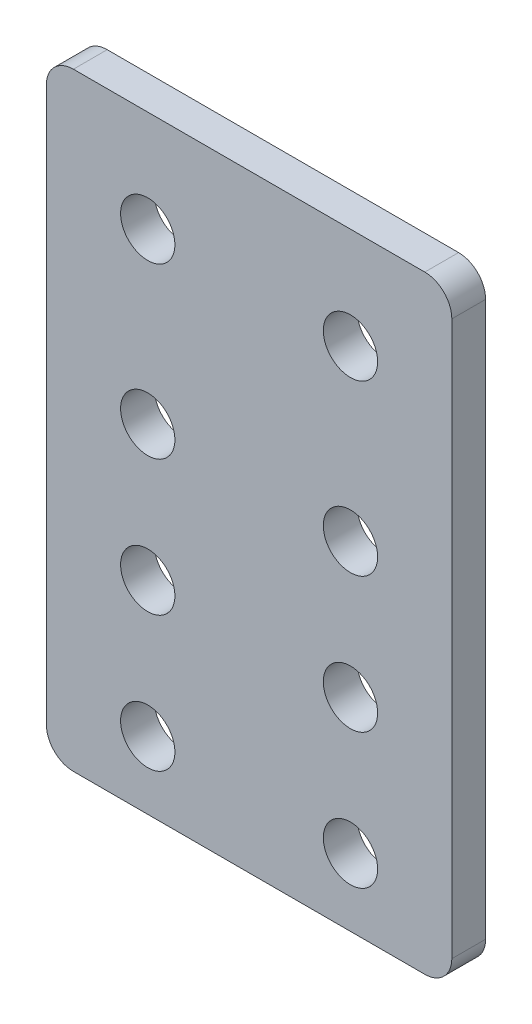
ISO-10303-21;
HEADER;
FILE_DESCRIPTION(('STEP AP214'),'2;1');
FILE_NAME('part.step','',(''),(''),'','','');
FILE_SCHEMA(('AUTOMOTIVE_DESIGN { 1 0 10303 214 1 1 1 1 }'));
ENDSEC;
DATA;
#1=APPLICATION_CONTEXT('core data for automotive mechanical design processes');
#2=APPLICATION_PROTOCOL_DEFINITION('international standard','automotive_design',2000,#1);
#3=PRODUCT_CONTEXT('',#1,'mechanical');
#4=PRODUCT('Part','Part','',(#3));
#5=PRODUCT_RELATED_PRODUCT_CATEGORY('part','',(#4));
#6=PRODUCT_DEFINITION_FORMATION('','',#4);
#7=PRODUCT_DEFINITION_CONTEXT('part definition',#1,'design');
#8=PRODUCT_DEFINITION('design','',#6,#7);
#9=PRODUCT_DEFINITION_SHAPE('','',#8);
#10=(LENGTH_UNIT() NAMED_UNIT(*) SI_UNIT(.MILLI.,.METRE.));
#11=(NAMED_UNIT(*) PLANE_ANGLE_UNIT() SI_UNIT($,.RADIAN.));
#12=(NAMED_UNIT(*) SI_UNIT($,.STERADIAN.) SOLID_ANGLE_UNIT());
#13=UNCERTAINTY_MEASURE_WITH_UNIT(LENGTH_MEASURE(1.E-05),#10,'distance_accuracy_value','');
#14=(GEOMETRIC_REPRESENTATION_CONTEXT(3) GLOBAL_UNCERTAINTY_ASSIGNED_CONTEXT((#13)) GLOBAL_UNIT_ASSIGNED_CONTEXT((#10,
#11,#12)) REPRESENTATION_CONTEXT('',''));
#15=CARTESIAN_POINT('',(0.,0.,0.));
#16=DIRECTION('',(0.,0.,1.));
#17=DIRECTION('',(1.,0.,0.));
#18=AXIS2_PLACEMENT_3D('',#15,#16,#17);
#19=CARTESIAN_POINT('',(0.,0.,3.175));
#20=DIRECTION('',(0.,0.,-1.));
#21=DIRECTION('',(-1.,0.,0.));
#22=AXIS2_PLACEMENT_3D('',#19,#20,#21);
#23=PLANE('',#22);
#24=DIRECTION('',(-1.,0.,0.));
#25=VECTOR('',#24,1.);
#26=CARTESIAN_POINT('',(-19.05,28.575,3.175));
#27=LINE('',#26,#25);
#28=CARTESIAN_POINT('',(16.51,28.575,3.175));
#29=VERTEX_POINT('',#28);
#30=CARTESIAN_POINT('',(-16.51,28.575,3.175));
#31=VERTEX_POINT('',#30);
#32=EDGE_CURVE('E196',#29,#31,#27,.T.);
#33=ORIENTED_EDGE('',*,*,#32,.T.);
#34=CARTESIAN_POINT('',(-16.51,26.035,3.175));
#35=DIRECTION('',(0.,0.,-1.));
#36=DIRECTION('',(-1.,0.,0.));
#37=AXIS2_PLACEMENT_3D('',#34,#35,#36);
#38=CIRCLE('',#37,2.54);
#39=CARTESIAN_POINT('',(-19.05,26.035,3.175));
#40=VERTEX_POINT('',#39);
#41=EDGE_CURVE('E172',#31,#40,#38,.F.);
#42=ORIENTED_EDGE('',*,*,#41,.T.);
#43=DIRECTION('',(0.,-1.,0.));
#44=VECTOR('',#43,1.);
#45=CARTESIAN_POINT('',(-19.05,-28.575,3.175));
#46=LINE('',#45,#44);
#47=CARTESIAN_POINT('',(-19.05,-26.035,3.175));
#48=VERTEX_POINT('',#47);
#49=EDGE_CURVE('E129',#40,#48,#46,.T.);
#50=ORIENTED_EDGE('',*,*,#49,.T.);
#51=CARTESIAN_POINT('',(-16.51,-26.035,3.175));
#52=DIRECTION('',(0.,0.,-1.));
#53=DIRECTION('',(-1.,0.,0.));
#54=AXIS2_PLACEMENT_3D('',#51,#52,#53);
#55=CIRCLE('',#54,2.54);
#56=CARTESIAN_POINT('',(-16.51,-28.575,3.175));
#57=VERTEX_POINT('',#56);
#58=EDGE_CURVE('E64',#48,#57,#55,.F.);
#59=ORIENTED_EDGE('',*,*,#58,.T.);
#60=DIRECTION('',(1.,0.,0.));
#61=VECTOR('',#60,1.);
#62=CARTESIAN_POINT('',(-19.05,-28.575,3.175));
#63=LINE('',#62,#61);
#64=CARTESIAN_POINT('',(16.51,-28.575,3.175));
#65=VERTEX_POINT('',#64);
#66=EDGE_CURVE('E150',#57,#65,#63,.T.);
#67=ORIENTED_EDGE('',*,*,#66,.T.);
#68=CARTESIAN_POINT('',(16.51,-26.035,3.175));
#69=DIRECTION('',(0.,0.,-1.));
#70=DIRECTION('',(-1.,0.,0.));
#71=AXIS2_PLACEMENT_3D('',#68,#69,#70);
#72=CIRCLE('',#71,2.54);
#73=CARTESIAN_POINT('',(19.05,-26.035,3.175));
#74=VERTEX_POINT('',#73);
#75=EDGE_CURVE('E167',#65,#74,#72,.F.);
#76=ORIENTED_EDGE('',*,*,#75,.T.);
#77=DIRECTION('',(0.,1.,0.));
#78=VECTOR('',#77,1.);
#79=CARTESIAN_POINT('',(19.05,-28.575,3.175));
#80=LINE('',#79,#78);
#81=CARTESIAN_POINT('',(19.05,26.035,3.175));
#82=VERTEX_POINT('',#81);
#83=EDGE_CURVE('E143',#74,#82,#80,.T.);
#84=ORIENTED_EDGE('',*,*,#83,.T.);
#85=CARTESIAN_POINT('',(16.51,26.035,3.175));
#86=DIRECTION('',(0.,0.,-1.));
#87=DIRECTION('',(-1.,0.,0.));
#88=AXIS2_PLACEMENT_3D('',#85,#86,#87);
#89=CIRCLE('',#88,2.54);
#90=EDGE_CURVE('E164',#82,#29,#89,.F.);
#91=ORIENTED_EDGE('',*,*,#90,.T.);
#92=EDGE_LOOP('',(#33,#42,#50,#59,#67,#76,#84,#91));
#93=FACE_BOUND('',#92,.T.);
#94=CARTESIAN_POINT('',(-9.525,-22.225,3.175));
#95=DIRECTION('',(0.,0.,1.));
#96=DIRECTION('',(1.,0.,0.));
#97=AXIS2_PLACEMENT_3D('',#94,#95,#96);
#98=CIRCLE('',#97,2.5527);
#99=CARTESIAN_POINT('',(-6.9723,-22.225,3.175));
#100=VERTEX_POINT('',#99);
#101=EDGE_CURVE('E202',#100,#100,#98,.T.);
#102=ORIENTED_EDGE('',*,*,#101,.F.);
#103=EDGE_LOOP('',(#102));
#104=FACE_BOUND('',#103,.T.);
#105=CARTESIAN_POINT('',(-9.525,-9.525,3.175));
#106=DIRECTION('',(0.,0.,1.));
#107=DIRECTION('',(1.,0.,0.));
#108=AXIS2_PLACEMENT_3D('',#105,#106,#107);
#109=CIRCLE('',#108,2.5527);
#110=CARTESIAN_POINT('',(-6.9723,-9.525,3.175));
#111=VERTEX_POINT('',#110);
#112=EDGE_CURVE('E216',#111,#111,#109,.T.);
#113=ORIENTED_EDGE('',*,*,#112,.F.);
#114=EDGE_LOOP('',(#113));
#115=FACE_BOUND('',#114,.T.);
#116=CARTESIAN_POINT('',(-9.525,3.175,3.175));
#117=DIRECTION('',(0.,0.,1.));
#118=DIRECTION('',(1.,0.,0.));
#119=AXIS2_PLACEMENT_3D('',#116,#117,#118);
#120=CIRCLE('',#119,2.5527);
#121=CARTESIAN_POINT('',(-6.9723,3.175,3.175));
#122=VERTEX_POINT('',#121);
#123=EDGE_CURVE('E222',#122,#122,#120,.T.);
#124=ORIENTED_EDGE('',*,*,#123,.F.);
#125=EDGE_LOOP('',(#124));
#126=FACE_BOUND('',#125,.T.);
#127=CARTESIAN_POINT('',(-9.525,19.05,3.175));
#128=DIRECTION('',(0.,0.,1.));
#129=DIRECTION('',(1.,0.,0.));
#130=AXIS2_PLACEMENT_3D('',#127,#128,#129);
#131=CIRCLE('',#130,2.5527);
#132=CARTESIAN_POINT('',(-6.9723,19.05,3.175));
#133=VERTEX_POINT('',#132);
#134=EDGE_CURVE('E230',#133,#133,#131,.T.);
#135=ORIENTED_EDGE('',*,*,#134,.F.);
#136=EDGE_LOOP('',(#135));
#137=FACE_BOUND('',#136,.T.);
#138=CARTESIAN_POINT('',(9.52500000000001,-22.225,3.175));
#139=DIRECTION('',(0.,0.,1.));
#140=DIRECTION('',(1.,0.,0.));
#141=AXIS2_PLACEMENT_3D('',#138,#139,#140);
#142=CIRCLE('',#141,2.5527);
#143=CARTESIAN_POINT('',(12.0777,-22.225,3.175));
#144=VERTEX_POINT('',#143);
#145=EDGE_CURVE('E238',#144,#144,#142,.T.);
#146=ORIENTED_EDGE('',*,*,#145,.F.);
#147=EDGE_LOOP('',(#146));
#148=FACE_BOUND('',#147,.T.);
#149=CARTESIAN_POINT('',(9.52500000000001,-9.52499999999999,3.175));
#150=DIRECTION('',(0.,0.,1.));
#151=DIRECTION('',(1.,0.,0.));
#152=AXIS2_PLACEMENT_3D('',#149,#150,#151);
#153=CIRCLE('',#152,2.5527);
#154=CARTESIAN_POINT('',(12.0777,-9.52499999999999,3.175));
#155=VERTEX_POINT('',#154);
#156=EDGE_CURVE('E246',#155,#155,#153,.T.);
#157=ORIENTED_EDGE('',*,*,#156,.F.);
#158=EDGE_LOOP('',(#157));
#159=FACE_BOUND('',#158,.T.);
#160=CARTESIAN_POINT('',(9.52500000000001,3.17500000000001,3.175));
#161=DIRECTION('',(0.,0.,1.));
#162=DIRECTION('',(-1.,0.,0.));
#163=AXIS2_PLACEMENT_3D('',#160,#161,#162);
#164=CIRCLE('',#163,2.5527);
#165=CARTESIAN_POINT('',(6.97230000000001,3.17500000000001,3.175));
#166=VERTEX_POINT('',#165);
#167=EDGE_CURVE('E254',#166,#166,#164,.T.);
#168=ORIENTED_EDGE('',*,*,#167,.F.);
#169=EDGE_LOOP('',(#168));
#170=FACE_BOUND('',#169,.T.);
#171=CARTESIAN_POINT('',(9.525,19.05,3.175));
#172=DIRECTION('',(0.,0.,1.));
#173=DIRECTION('',(-1.,0.,0.));
#174=AXIS2_PLACEMENT_3D('',#171,#172,#173);
#175=CIRCLE('',#174,2.5527);
#176=CARTESIAN_POINT('',(6.9723,19.05,3.175));
#177=VERTEX_POINT('',#176);
#178=EDGE_CURVE('E262',#177,#177,#175,.T.);
#179=ORIENTED_EDGE('',*,*,#178,.F.);
#180=EDGE_LOOP('',(#179));
#181=FACE_BOUND('',#180,.T.);
#182=ADVANCED_FACE('F41',(#93,#104,#115,#126,#137,#148,#159,#170,#181),#23,.F.);
#183=CARTESIAN_POINT('',(0.,0.,0.));
#184=DIRECTION('',(0.,0.,-1.));
#185=DIRECTION('',(-1.,0.,0.));
#186=AXIS2_PLACEMENT_3D('',#183,#184,#185);
#187=PLANE('',#186);
#188=CARTESIAN_POINT('',(9.52500000000001,3.17500000000001,0.));
#189=DIRECTION('',(0.,0.,1.));
#190=DIRECTION('',(-1.,0.,0.));
#191=AXIS2_PLACEMENT_3D('',#188,#189,#190);
#192=CIRCLE('',#191,2.5527);
#193=CARTESIAN_POINT('',(6.97230000000001,3.17500000000001,0.));
#194=VERTEX_POINT('',#193);
#195=EDGE_CURVE('E258',#194,#194,#192,.T.);
#196=ORIENTED_EDGE('',*,*,#195,.T.);
#197=EDGE_LOOP('',(#196));
#198=FACE_BOUND('',#197,.T.);
#199=CARTESIAN_POINT('',(9.52500000000001,-22.225,0.));
#200=DIRECTION('',(0.,0.,1.));
#201=DIRECTION('',(1.,0.,0.));
#202=AXIS2_PLACEMENT_3D('',#199,#200,#201);
#203=CIRCLE('',#202,2.5527);
#204=CARTESIAN_POINT('',(12.0777,-22.225,0.));
#205=VERTEX_POINT('',#204);
#206=EDGE_CURVE('E242',#205,#205,#203,.T.);
#207=ORIENTED_EDGE('',*,*,#206,.T.);
#208=EDGE_LOOP('',(#207));
#209=FACE_BOUND('',#208,.T.);
#210=CARTESIAN_POINT('',(-9.525,3.175,0.));
#211=DIRECTION('',(0.,0.,1.));
#212=DIRECTION('',(1.,0.,0.));
#213=AXIS2_PLACEMENT_3D('',#210,#211,#212);
#214=CIRCLE('',#213,2.5527);
#215=CARTESIAN_POINT('',(-6.9723,3.175,0.));
#216=VERTEX_POINT('',#215);
#217=EDGE_CURVE('E226',#216,#216,#214,.T.);
#218=ORIENTED_EDGE('',*,*,#217,.T.);
#219=EDGE_LOOP('',(#218));
#220=FACE_BOUND('',#219,.T.);
#221=CARTESIAN_POINT('',(-9.525,-22.225,0.));
#222=DIRECTION('',(0.,0.,1.));
#223=DIRECTION('',(1.,0.,0.));
#224=AXIS2_PLACEMENT_3D('',#221,#222,#223);
#225=CIRCLE('',#224,2.5527);
#226=CARTESIAN_POINT('',(-6.9723,-22.225,0.));
#227=VERTEX_POINT('',#226);
#228=EDGE_CURVE('E205',#227,#227,#225,.T.);
#229=ORIENTED_EDGE('',*,*,#228,.T.);
#230=EDGE_LOOP('',(#229));
#231=FACE_BOUND('',#230,.T.);
#232=DIRECTION('',(0.,-1.,0.));
#233=VECTOR('',#232,1.);
#234=CARTESIAN_POINT('',(-19.05,-28.575,0.));
#235=LINE('',#234,#233);
#236=CARTESIAN_POINT('',(-19.05,26.035,0.));
#237=VERTEX_POINT('',#236);
#238=CARTESIAN_POINT('',(-19.05,-26.035,0.));
#239=VERTEX_POINT('',#238);
#240=EDGE_CURVE('E127',#237,#239,#235,.T.);
#241=ORIENTED_EDGE('',*,*,#240,.F.);
#242=CARTESIAN_POINT('',(-16.51,26.035,0.));
#243=DIRECTION('',(0.,0.,-1.));
#244=DIRECTION('',(-1.,0.,0.));
#245=AXIS2_PLACEMENT_3D('',#242,#243,#244);
#246=CIRCLE('',#245,2.54);
#247=CARTESIAN_POINT('',(-16.51,28.575,0.));
#248=VERTEX_POINT('',#247);
#249=EDGE_CURVE('E109',#237,#248,#246,.T.);
#250=ORIENTED_EDGE('',*,*,#249,.T.);
#251=DIRECTION('',(-1.,0.,0.));
#252=VECTOR('',#251,1.);
#253=CARTESIAN_POINT('',(-19.05,28.575,0.));
#254=LINE('',#253,#252);
#255=CARTESIAN_POINT('',(16.51,28.575,0.));
#256=VERTEX_POINT('',#255);
#257=EDGE_CURVE('E139',#256,#248,#254,.T.);
#258=ORIENTED_EDGE('',*,*,#257,.F.);
#259=CARTESIAN_POINT('',(16.51,26.035,0.));
#260=DIRECTION('',(0.,0.,-1.));
#261=DIRECTION('',(-1.,0.,0.));
#262=AXIS2_PLACEMENT_3D('',#259,#260,#261);
#263=CIRCLE('',#262,2.54);
#264=CARTESIAN_POINT('',(19.05,26.035,0.));
#265=VERTEX_POINT('',#264);
#266=EDGE_CURVE('E131',#256,#265,#263,.T.);
#267=ORIENTED_EDGE('',*,*,#266,.T.);
#268=DIRECTION('',(0.,1.,0.));
#269=VECTOR('',#268,1.);
#270=CARTESIAN_POINT('',(19.05,-28.575,0.));
#271=LINE('',#270,#269);
#272=CARTESIAN_POINT('',(19.05,-26.035,0.));
#273=VERTEX_POINT('',#272);
#274=EDGE_CURVE('E145',#273,#265,#271,.T.);
#275=ORIENTED_EDGE('',*,*,#274,.F.);
#276=CARTESIAN_POINT('',(16.51,-26.035,0.));
#277=DIRECTION('',(0.,0.,-1.));
#278=DIRECTION('',(-1.,0.,0.));
#279=AXIS2_PLACEMENT_3D('',#276,#277,#278);
#280=CIRCLE('',#279,2.54);
#281=CARTESIAN_POINT('',(16.51,-28.575,0.));
#282=VERTEX_POINT('',#281);
#283=EDGE_CURVE('E154',#273,#282,#280,.T.);
#284=ORIENTED_EDGE('',*,*,#283,.T.);
#285=DIRECTION('',(1.,0.,0.));
#286=VECTOR('',#285,1.);
#287=CARTESIAN_POINT('',(-19.05,-28.575,0.));
#288=LINE('',#287,#286);
#289=CARTESIAN_POINT('',(-16.51,-28.575,0.));
#290=VERTEX_POINT('',#289);
#291=EDGE_CURVE('E138',#290,#282,#288,.T.);
#292=ORIENTED_EDGE('',*,*,#291,.F.);
#293=CARTESIAN_POINT('',(-16.51,-26.035,0.));
#294=DIRECTION('',(0.,0.,-1.));
#295=DIRECTION('',(-1.,0.,0.));
#296=AXIS2_PLACEMENT_3D('',#293,#294,#295);
#297=CIRCLE('',#296,2.54);
#298=EDGE_CURVE('E121',#290,#239,#297,.T.);
#299=ORIENTED_EDGE('',*,*,#298,.T.);
#300=EDGE_LOOP('',(#241,#250,#258,#267,#275,#284,#292,#299));
#301=FACE_BOUND('',#300,.T.);
#302=CARTESIAN_POINT('',(-9.525,-9.525,0.));
#303=DIRECTION('',(0.,0.,1.));
#304=DIRECTION('',(1.,0.,0.));
#305=AXIS2_PLACEMENT_3D('',#302,#303,#304);
#306=CIRCLE('',#305,2.5527);
#307=CARTESIAN_POINT('',(-6.9723,-9.525,0.));
#308=VERTEX_POINT('',#307);
#309=EDGE_CURVE('E218',#308,#308,#306,.T.);
#310=ORIENTED_EDGE('',*,*,#309,.T.);
#311=EDGE_LOOP('',(#310));
#312=FACE_BOUND('',#311,.T.);
#313=CARTESIAN_POINT('',(-9.525,19.05,0.));
#314=DIRECTION('',(0.,0.,1.));
#315=DIRECTION('',(1.,0.,0.));
#316=AXIS2_PLACEMENT_3D('',#313,#314,#315);
#317=CIRCLE('',#316,2.5527);
#318=CARTESIAN_POINT('',(-6.9723,19.05,0.));
#319=VERTEX_POINT('',#318);
#320=EDGE_CURVE('E234',#319,#319,#317,.T.);
#321=ORIENTED_EDGE('',*,*,#320,.T.);
#322=EDGE_LOOP('',(#321));
#323=FACE_BOUND('',#322,.T.);
#324=CARTESIAN_POINT('',(9.52500000000001,-9.52499999999999,0.));
#325=DIRECTION('',(0.,0.,1.));
#326=DIRECTION('',(1.,0.,0.));
#327=AXIS2_PLACEMENT_3D('',#324,#325,#326);
#328=CIRCLE('',#327,2.5527);
#329=CARTESIAN_POINT('',(12.0777,-9.52499999999999,0.));
#330=VERTEX_POINT('',#329);
#331=EDGE_CURVE('E250',#330,#330,#328,.T.);
#332=ORIENTED_EDGE('',*,*,#331,.T.);
#333=EDGE_LOOP('',(#332));
#334=FACE_BOUND('',#333,.T.);
#335=CARTESIAN_POINT('',(9.525,19.05,0.));
#336=DIRECTION('',(0.,0.,1.));
#337=DIRECTION('',(-1.,0.,0.));
#338=AXIS2_PLACEMENT_3D('',#335,#336,#337);
#339=CIRCLE('',#338,2.5527);
#340=CARTESIAN_POINT('',(6.9723,19.05,0.));
#341=VERTEX_POINT('',#340);
#342=EDGE_CURVE('E266',#341,#341,#339,.T.);
#343=ORIENTED_EDGE('',*,*,#342,.T.);
#344=EDGE_LOOP('',(#343));
#345=FACE_BOUND('',#344,.T.);
#346=ADVANCED_FACE('F134',(#198,#209,#220,#231,#301,#312,#323,#334,#345),#187,.T.);
#347=CARTESIAN_POINT('',(19.05,-28.575,3.175));
#348=DIRECTION('',(-1.,0.,0.));
#349=DIRECTION('',(0.,-1.,0.));
#350=AXIS2_PLACEMENT_3D('',#347,#348,#349);
#351=PLANE('',#350);
#352=ORIENTED_EDGE('',*,*,#83,.F.);
#353=DIRECTION('',(0.,0.,-1.));
#354=VECTOR('',#353,1.);
#355=CARTESIAN_POINT('',(19.05,-26.035,3.175));
#356=LINE('',#355,#354);
#357=EDGE_CURVE('E11',#74,#273,#356,.T.);
#358=ORIENTED_EDGE('',*,*,#357,.T.);
#359=ORIENTED_EDGE('',*,*,#274,.T.);
#360=DIRECTION('',(0.,0.,-1.));
#361=VECTOR('',#360,1.);
#362=CARTESIAN_POINT('',(19.05,26.035,3.175));
#363=LINE('',#362,#361);
#364=EDGE_CURVE('E50',#265,#82,#363,.F.);
#365=ORIENTED_EDGE('',*,*,#364,.T.);
#366=EDGE_LOOP('',(#352,#358,#359,#365));
#367=FACE_BOUND('',#366,.T.);
#368=ADVANCED_FACE('F186',(#367),#351,.F.);
#369=CARTESIAN_POINT('',(-19.05,28.575,3.175));
#370=DIRECTION('',(0.,-1.,0.));
#371=DIRECTION('',(1.,0.,0.));
#372=AXIS2_PLACEMENT_3D('',#369,#370,#371);
#373=PLANE('',#372);
#374=ORIENTED_EDGE('',*,*,#257,.T.);
#375=DIRECTION('',(0.,0.,-1.));
#376=VECTOR('',#375,1.);
#377=CARTESIAN_POINT('',(-16.51,28.575,3.175));
#378=LINE('',#377,#376);
#379=EDGE_CURVE('E114',#248,#31,#378,.F.);
#380=ORIENTED_EDGE('',*,*,#379,.T.);
#381=ORIENTED_EDGE('',*,*,#32,.F.);
#382=DIRECTION('',(0.,0.,-1.));
#383=VECTOR('',#382,1.);
#384=CARTESIAN_POINT('',(16.51,28.575,3.175));
#385=LINE('',#384,#383);
#386=EDGE_CURVE('E120',#29,#256,#385,.T.);
#387=ORIENTED_EDGE('',*,*,#386,.T.);
#388=EDGE_LOOP('',(#374,#380,#381,#387));
#389=FACE_BOUND('',#388,.T.);
#390=ADVANCED_FACE('F200',(#389),#373,.F.);
#391=CARTESIAN_POINT('',(-19.05,-28.575,3.175));
#392=DIRECTION('',(1.,0.,0.));
#393=DIRECTION('',(0.,0.,-1.));
#394=AXIS2_PLACEMENT_3D('',#391,#392,#393);
#395=PLANE('',#394);
#396=ORIENTED_EDGE('',*,*,#49,.F.);
#397=DIRECTION('',(0.,0.,-1.));
#398=VECTOR('',#397,1.);
#399=CARTESIAN_POINT('',(-19.05,26.035,3.175));
#400=LINE('',#399,#398);
#401=EDGE_CURVE('E113',#40,#237,#400,.T.);
#402=ORIENTED_EDGE('',*,*,#401,.T.);
#403=ORIENTED_EDGE('',*,*,#240,.T.);
#404=DIRECTION('',(0.,0.,-1.));
#405=VECTOR('',#404,1.);
#406=CARTESIAN_POINT('',(-19.05,-26.035,3.175));
#407=LINE('',#406,#405);
#408=EDGE_CURVE('E132',#239,#48,#407,.F.);
#409=ORIENTED_EDGE('',*,*,#408,.T.);
#410=EDGE_LOOP('',(#396,#402,#403,#409));
#411=FACE_BOUND('',#410,.T.);
#412=ADVANCED_FACE('F126',(#411),#395,.F.);
#413=CARTESIAN_POINT('',(-19.05,-28.575,3.175));
#414=DIRECTION('',(0.,1.,0.));
#415=DIRECTION('',(-1.,0.,0.));
#416=AXIS2_PLACEMENT_3D('',#413,#414,#415);
#417=PLANE('',#416);
#418=ORIENTED_EDGE('',*,*,#66,.F.);
#419=DIRECTION('',(0.,0.,-1.));
#420=VECTOR('',#419,1.);
#421=CARTESIAN_POINT('',(-16.51,-28.575,3.175));
#422=LINE('',#421,#420);
#423=EDGE_CURVE('E177',#57,#290,#422,.T.);
#424=ORIENTED_EDGE('',*,*,#423,.T.);
#425=ORIENTED_EDGE('',*,*,#291,.T.);
#426=DIRECTION('',(0.,0.,-1.));
#427=VECTOR('',#426,1.);
#428=CARTESIAN_POINT('',(16.51,-28.575,3.175));
#429=LINE('',#428,#427);
#430=EDGE_CURVE('E57',#282,#65,#429,.F.);
#431=ORIENTED_EDGE('',*,*,#430,.T.);
#432=EDGE_LOOP('',(#418,#424,#425,#431));
#433=FACE_BOUND('',#432,.T.);
#434=ADVANCED_FACE('F288',(#433),#417,.F.);
#435=CARTESIAN_POINT('',(-9.525,-22.225,3.175));
#436=DIRECTION('',(0.,0.,-1.));
#437=DIRECTION('',(-1.,0.,0.));
#438=AXIS2_PLACEMENT_3D('',#435,#436,#437);
#439=CYLINDRICAL_SURFACE('',#438,2.5527);
#440=ORIENTED_EDGE('',*,*,#101,.T.);
#441=EDGE_LOOP('',(#440));
#442=FACE_BOUND('',#441,.T.);
#443=ORIENTED_EDGE('',*,*,#228,.F.);
#444=EDGE_LOOP('',(#443));
#445=FACE_BOUND('',#444,.T.);
#446=ADVANCED_FACE('F285',(#442,#445),#439,.F.);
#447=CARTESIAN_POINT('',(-9.525,-9.525,3.175));
#448=DIRECTION('',(0.,0.,-1.));
#449=DIRECTION('',(-1.,0.,0.));
#450=AXIS2_PLACEMENT_3D('',#447,#448,#449);
#451=CYLINDRICAL_SURFACE('',#450,2.5527);
#452=ORIENTED_EDGE('',*,*,#112,.T.);
#453=EDGE_LOOP('',(#452));
#454=FACE_BOUND('',#453,.T.);
#455=ORIENTED_EDGE('',*,*,#309,.F.);
#456=EDGE_LOOP('',(#455));
#457=FACE_BOUND('',#456,.T.);
#458=ADVANCED_FACE('F420',(#454,#457),#451,.F.);
#459=CARTESIAN_POINT('',(-9.525,3.175,3.175));
#460=DIRECTION('',(0.,0.,-1.));
#461=DIRECTION('',(-1.,0.,0.));
#462=AXIS2_PLACEMENT_3D('',#459,#460,#461);
#463=CYLINDRICAL_SURFACE('',#462,2.5527);
#464=ORIENTED_EDGE('',*,*,#123,.T.);
#465=EDGE_LOOP('',(#464));
#466=FACE_BOUND('',#465,.T.);
#467=ORIENTED_EDGE('',*,*,#217,.F.);
#468=EDGE_LOOP('',(#467));
#469=FACE_BOUND('',#468,.T.);
#470=ADVANCED_FACE('F410',(#466,#469),#463,.F.);
#471=CARTESIAN_POINT('',(-9.525,19.05,3.175));
#472=DIRECTION('',(0.,0.,-1.));
#473=DIRECTION('',(-1.,0.,0.));
#474=AXIS2_PLACEMENT_3D('',#471,#472,#473);
#475=CYLINDRICAL_SURFACE('',#474,2.5527);
#476=ORIENTED_EDGE('',*,*,#134,.T.);
#477=EDGE_LOOP('',(#476));
#478=FACE_BOUND('',#477,.T.);
#479=ORIENTED_EDGE('',*,*,#320,.F.);
#480=EDGE_LOOP('',(#479));
#481=FACE_BOUND('',#480,.T.);
#482=ADVANCED_FACE('F400',(#478,#481),#475,.F.);
#483=CARTESIAN_POINT('',(9.52500000000001,-22.225,3.175));
#484=DIRECTION('',(0.,0.,-1.));
#485=DIRECTION('',(-1.,0.,0.));
#486=AXIS2_PLACEMENT_3D('',#483,#484,#485);
#487=CYLINDRICAL_SURFACE('',#486,2.5527);
#488=ORIENTED_EDGE('',*,*,#145,.T.);
#489=EDGE_LOOP('',(#488));
#490=FACE_BOUND('',#489,.T.);
#491=ORIENTED_EDGE('',*,*,#206,.F.);
#492=EDGE_LOOP('',(#491));
#493=FACE_BOUND('',#492,.T.);
#494=ADVANCED_FACE('F390',(#490,#493),#487,.F.);
#495=CARTESIAN_POINT('',(9.52500000000001,-9.52499999999999,3.175));
#496=DIRECTION('',(0.,0.,-1.));
#497=DIRECTION('',(-1.,0.,0.));
#498=AXIS2_PLACEMENT_3D('',#495,#496,#497);
#499=CYLINDRICAL_SURFACE('',#498,2.5527);
#500=ORIENTED_EDGE('',*,*,#156,.T.);
#501=EDGE_LOOP('',(#500));
#502=FACE_BOUND('',#501,.T.);
#503=ORIENTED_EDGE('',*,*,#331,.F.);
#504=EDGE_LOOP('',(#503));
#505=FACE_BOUND('',#504,.T.);
#506=ADVANCED_FACE('F380',(#502,#505),#499,.F.);
#507=CARTESIAN_POINT('',(9.52500000000001,3.17500000000001,3.175));
#508=DIRECTION('',(0.,0.,-1.));
#509=DIRECTION('',(-1.,0.,0.));
#510=AXIS2_PLACEMENT_3D('',#507,#508,#509);
#511=CYLINDRICAL_SURFACE('',#510,2.5527);
#512=ORIENTED_EDGE('',*,*,#167,.T.);
#513=EDGE_LOOP('',(#512));
#514=FACE_BOUND('',#513,.T.);
#515=ORIENTED_EDGE('',*,*,#195,.F.);
#516=EDGE_LOOP('',(#515));
#517=FACE_BOUND('',#516,.T.);
#518=ADVANCED_FACE('F371',(#514,#517),#511,.F.);
#519=CARTESIAN_POINT('',(9.525,19.05,3.175));
#520=DIRECTION('',(0.,0.,-1.));
#521=DIRECTION('',(-1.,0.,0.));
#522=AXIS2_PLACEMENT_3D('',#519,#520,#521);
#523=CYLINDRICAL_SURFACE('',#522,2.5527);
#524=ORIENTED_EDGE('',*,*,#178,.T.);
#525=EDGE_LOOP('',(#524));
#526=FACE_BOUND('',#525,.T.);
#527=ORIENTED_EDGE('',*,*,#342,.F.);
#528=EDGE_LOOP('',(#527));
#529=FACE_BOUND('',#528,.T.);
#530=ADVANCED_FACE('F274',(#526,#529),#523,.F.);
#531=CARTESIAN_POINT('',(-16.51,26.035,3.175));
#532=DIRECTION('',(0.,0.,-1.));
#533=DIRECTION('',(-1.,0.,0.));
#534=AXIS2_PLACEMENT_3D('',#531,#532,#533);
#535=CYLINDRICAL_SURFACE('',#534,2.54);
#536=ORIENTED_EDGE('',*,*,#41,.F.);
#537=ORIENTED_EDGE('',*,*,#379,.F.);
#538=ORIENTED_EDGE('',*,*,#249,.F.);
#539=ORIENTED_EDGE('',*,*,#401,.F.);
#540=EDGE_LOOP('',(#536,#537,#538,#539));
#541=FACE_BOUND('',#540,.T.);
#542=ADVANCED_FACE('F112',(#541),#535,.T.);
#543=CARTESIAN_POINT('',(-16.51,-26.035,3.175));
#544=DIRECTION('',(0.,0.,-1.));
#545=DIRECTION('',(-1.,0.,0.));
#546=AXIS2_PLACEMENT_3D('',#543,#544,#545);
#547=CYLINDRICAL_SURFACE('',#546,2.54);
#548=ORIENTED_EDGE('',*,*,#58,.F.);
#549=ORIENTED_EDGE('',*,*,#408,.F.);
#550=ORIENTED_EDGE('',*,*,#298,.F.);
#551=ORIENTED_EDGE('',*,*,#423,.F.);
#552=EDGE_LOOP('',(#548,#549,#550,#551));
#553=FACE_BOUND('',#552,.T.);
#554=ADVANCED_FACE('F299',(#553),#547,.T.);
#555=CARTESIAN_POINT('',(16.51,-26.035,3.175));
#556=DIRECTION('',(0.,0.,-1.));
#557=DIRECTION('',(-1.,0.,0.));
#558=AXIS2_PLACEMENT_3D('',#555,#556,#557);
#559=CYLINDRICAL_SURFACE('',#558,2.54);
#560=ORIENTED_EDGE('',*,*,#75,.F.);
#561=ORIENTED_EDGE('',*,*,#430,.F.);
#562=ORIENTED_EDGE('',*,*,#283,.F.);
#563=ORIENTED_EDGE('',*,*,#357,.F.);
#564=EDGE_LOOP('',(#560,#561,#562,#563));
#565=FACE_BOUND('',#564,.T.);
#566=ADVANCED_FACE('F301',(#565),#559,.T.);
#567=CARTESIAN_POINT('',(16.51,26.035,3.175));
#568=DIRECTION('',(0.,0.,-1.));
#569=DIRECTION('',(-1.,0.,0.));
#570=AXIS2_PLACEMENT_3D('',#567,#568,#569);
#571=CYLINDRICAL_SURFACE('',#570,2.54);
#572=ORIENTED_EDGE('',*,*,#90,.F.);
#573=ORIENTED_EDGE('',*,*,#364,.F.);
#574=ORIENTED_EDGE('',*,*,#266,.F.);
#575=ORIENTED_EDGE('',*,*,#386,.F.);
#576=EDGE_LOOP('',(#572,#573,#574,#575));
#577=FACE_BOUND('',#576,.T.);
#578=ADVANCED_FACE('F43',(#577),#571,.T.);
#579=CLOSED_SHELL('',(#182,#346,#368,#390,#412,#434,#446,#458,#470,#482,#494,#506,#518,#530,
#542,#554,#566,#578));
#580=MANIFOLD_SOLID_BREP('B2',#579);
#581=ADVANCED_BREP_SHAPE_REPRESENTATION('',(#18,#580),#14);
#582=SHAPE_DEFINITION_REPRESENTATION(#9,#581);
ENDSEC;
END-ISO-10303-21;
